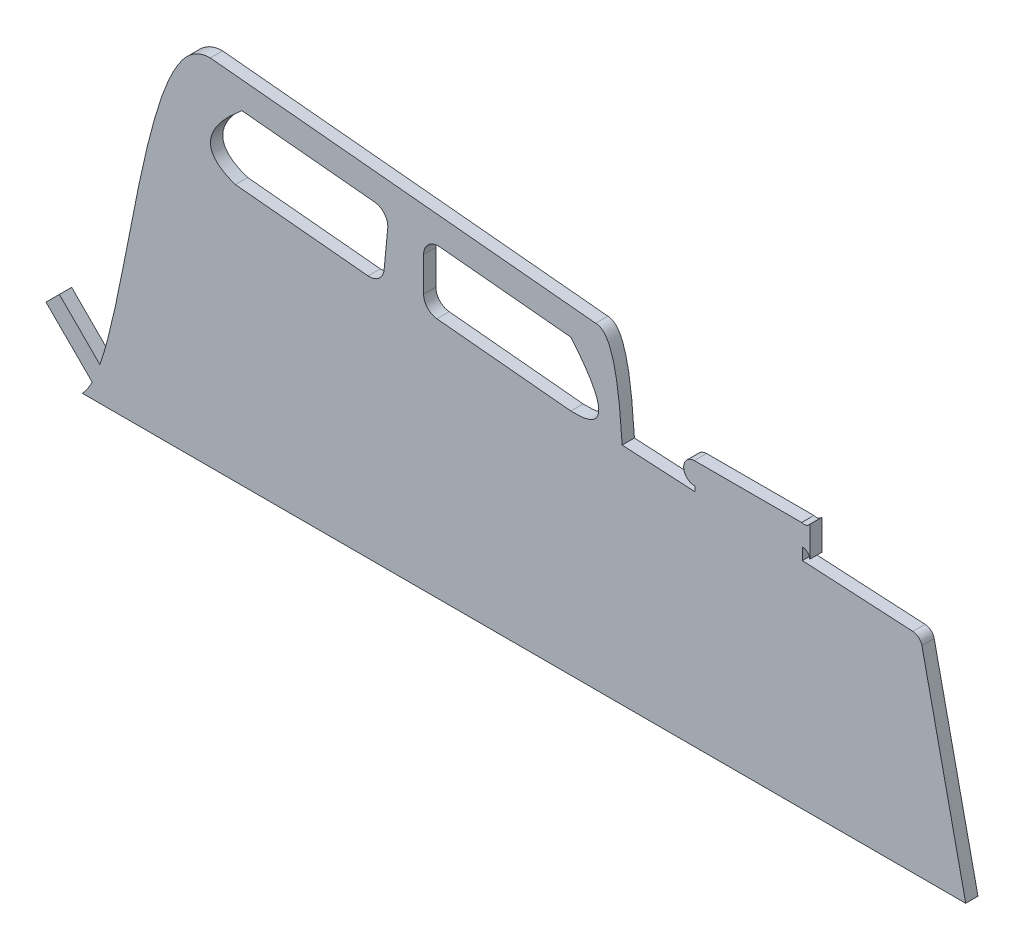
ISO-10303-21;
HEADER;
FILE_DESCRIPTION(('STEP AP214'),'2;1');
FILE_NAME('part.step','',(''),(''),'','','');
FILE_SCHEMA(('AUTOMOTIVE_DESIGN { 1 0 10303 214 1 1 1 1 }'));
ENDSEC;
DATA;
#1=APPLICATION_CONTEXT('core data for automotive mechanical design processes');
#2=APPLICATION_PROTOCOL_DEFINITION('international standard','automotive_design',2000,#1);
#3=PRODUCT_CONTEXT('',#1,'mechanical');
#4=PRODUCT('Part','Part','',(#3));
#5=PRODUCT_RELATED_PRODUCT_CATEGORY('part','',(#4));
#6=PRODUCT_DEFINITION_FORMATION('','',#4);
#7=PRODUCT_DEFINITION_CONTEXT('part definition',#1,'design');
#8=PRODUCT_DEFINITION('design','',#6,#7);
#9=PRODUCT_DEFINITION_SHAPE('','',#8);
#10=(LENGTH_UNIT() NAMED_UNIT(*) SI_UNIT(.MILLI.,.METRE.));
#11=(NAMED_UNIT(*) PLANE_ANGLE_UNIT() SI_UNIT($,.RADIAN.));
#12=(NAMED_UNIT(*) SI_UNIT($,.STERADIAN.) SOLID_ANGLE_UNIT());
#13=UNCERTAINTY_MEASURE_WITH_UNIT(LENGTH_MEASURE(1.E-05),#10,'distance_accuracy_value','');
#14=(GEOMETRIC_REPRESENTATION_CONTEXT(3) GLOBAL_UNCERTAINTY_ASSIGNED_CONTEXT((#13)) GLOBAL_UNIT_ASSIGNED_CONTEXT((#10,
#11,#12)) REPRESENTATION_CONTEXT('',''));
#15=CARTESIAN_POINT('',(0.,0.,0.));
#16=DIRECTION('',(0.,0.,1.));
#17=DIRECTION('',(1.,0.,0.));
#18=AXIS2_PLACEMENT_3D('',#15,#16,#17);
#19=CARTESIAN_POINT('',(3.17773604234742,3.17773604234742,3.175));
#20=DIRECTION('',(0.707106781186547,0.707106781186548,0.));
#21=DIRECTION('',(-0.707106781186548,0.707106781186547,0.));
#22=AXIS2_PLACEMENT_3D('',#19,#20,#21);
#23=PLANE('',#22);
#24=DIRECTION('',(0.707106781186548,-0.707106781186547,0.));
#25=VECTOR('',#24,1.);
#26=CARTESIAN_POINT('',(3.17773604234742,3.17773604234742,0.));
#27=LINE('',#26,#25);
#28=CARTESIAN_POINT('',(-9.36737866038823,15.7228507450831,0.));
#29=VERTEX_POINT('',#28);
#30=CARTESIAN_POINT('',(2.57905981794813,3.77641226674672,0.));
#31=VERTEX_POINT('',#30);
#32=EDGE_CURVE('E352',#29,#31,#27,.T.);
#33=ORIENTED_EDGE('',*,*,#32,.T.);
#34=DIRECTION('',(0.,0.,-1.));
#35=VECTOR('',#34,1.);
#36=CARTESIAN_POINT('',(2.57905981794813,3.77641226674672,3.175));
#37=LINE('',#36,#35);
#38=CARTESIAN_POINT('',(2.57905981794813,3.77641226674672,3.175));
#39=VERTEX_POINT('',#38);
#40=EDGE_CURVE('E11',#39,#31,#37,.T.);
#41=ORIENTED_EDGE('',*,*,#40,.F.);
#42=DIRECTION('',(0.707106781186548,-0.707106781186547,0.));
#43=VECTOR('',#42,1.);
#44=CARTESIAN_POINT('',(3.17773604234742,3.17773604234742,3.175));
#45=LINE('',#44,#43);
#46=CARTESIAN_POINT('',(-9.36737866038823,15.7228507450831,3.175));
#47=VERTEX_POINT('',#46);
#48=EDGE_CURVE('E363',#47,#39,#45,.T.);
#49=ORIENTED_EDGE('',*,*,#48,.F.);
#50=DIRECTION('',(0.,0.,-1.));
#51=VECTOR('',#50,1.);
#52=CARTESIAN_POINT('',(-9.36737866038823,15.7228507450831,3.175));
#53=LINE('',#52,#51);
#54=EDGE_CURVE('E485',#47,#29,#53,.T.);
#55=ORIENTED_EDGE('',*,*,#54,.T.);
#56=EDGE_LOOP('',(#33,#41,#49,#55));
#57=FACE_BOUND('',#56,.T.);
#58=ADVANCED_FACE('F35',(#57),#23,.F.);
#59=CARTESIAN_POINT('',(2.57905981794814,3.77641226674672,3.175));
#60=CARTESIAN_POINT('',(1.76772730176504,2.15682183703701,3.175));
#61=CARTESIAN_POINT('',(0.911850585689565,0.875503614465933,3.175));
#62=CARTESIAN_POINT('',(0.,0.,3.175));
#63=B_SPLINE_CURVE_WITH_KNOTS('',3,(#59,#60,#61,#62),.UNSPECIFIED.,.F.,.F.,(4,4),
(0.923802309139664,1.),.UNSPECIFIED.);
#64=DIRECTION('',(0.,0.,-1.));
#65=VECTOR('',#64,1.);
#66=SURFACE_OF_LINEAR_EXTRUSION('',#63,#65);
#67=CARTESIAN_POINT('',(2.57905981794814,3.77641226674672,0.));
#68=CARTESIAN_POINT('',(1.76772730176504,2.15682183703701,0.));
#69=CARTESIAN_POINT('',(0.911850585689565,0.875503614465933,0.));
#70=CARTESIAN_POINT('',(0.,0.,0.));
#71=B_SPLINE_CURVE_WITH_KNOTS('',3,(#67,#68,#69,#70),.UNSPECIFIED.,.F.,.F.,(4,4),
(0.923802309139664,1.),.UNSPECIFIED.);
#72=CARTESIAN_POINT('',(0.,0.,0.));
#73=VERTEX_POINT('',#72);
#74=EDGE_CURVE('E488',#31,#73,#71,.T.);
#75=ORIENTED_EDGE('',*,*,#74,.T.);
#76=DIRECTION('',(0.,0.,-1.));
#77=VECTOR('',#76,1.);
#78=CARTESIAN_POINT('',(0.,0.,3.175));
#79=LINE('',#78,#77);
#80=CARTESIAN_POINT('',(0.,0.,3.175));
#81=VERTEX_POINT('',#80);
#82=EDGE_CURVE('E42',#81,#73,#79,.T.);
#83=ORIENTED_EDGE('',*,*,#82,.F.);
#84=EDGE_CURVE('E366',#39,#81,#63,.T.);
#85=ORIENTED_EDGE('',*,*,#84,.F.);
#86=ORIENTED_EDGE('',*,*,#40,.T.);
#87=EDGE_LOOP('',(#75,#83,#85,#86));
#88=FACE_BOUND('',#87,.T.);
#89=ADVANCED_FACE('F377',(#88),#66,.F.);
#90=CARTESIAN_POINT('',(0.,0.,3.175));
#91=DIRECTION('',(0.,1.,0.));
#92=DIRECTION('',(0.,0.,1.));
#93=AXIS2_PLACEMENT_3D('',#90,#91,#92);
#94=PLANE('',#93);
#95=DIRECTION('',(1.,0.,0.));
#96=VECTOR('',#95,1.);
#97=CARTESIAN_POINT('',(0.,0.,0.));
#98=LINE('',#97,#96);
#99=CARTESIAN_POINT('',(228.6,0.,0.));
#100=VERTEX_POINT('',#99);
#101=EDGE_CURVE('E490',#73,#100,#98,.T.);
#102=ORIENTED_EDGE('',*,*,#101,.T.);
#103=DIRECTION('',(0.,0.,-1.));
#104=VECTOR('',#103,1.);
#105=CARTESIAN_POINT('',(228.6,0.,3.175));
#106=LINE('',#105,#104);
#107=CARTESIAN_POINT('',(228.6,0.,3.175));
#108=VERTEX_POINT('',#107);
#109=EDGE_CURVE('E587',#108,#100,#106,.T.);
#110=ORIENTED_EDGE('',*,*,#109,.F.);
#111=DIRECTION('',(1.,0.,0.));
#112=VECTOR('',#111,1.);
#113=CARTESIAN_POINT('',(0.,0.,3.175));
#114=LINE('',#113,#112);
#115=EDGE_CURVE('E372',#81,#108,#114,.T.);
#116=ORIENTED_EDGE('',*,*,#115,.F.);
#117=ORIENTED_EDGE('',*,*,#82,.T.);
#118=EDGE_LOOP('',(#102,#110,#116,#117));
#119=FACE_BOUND('',#118,.T.);
#120=ADVANCED_FACE('F380',(#119),#94,.F.);
#121=CARTESIAN_POINT('',(218.268204927033,47.4879180871345,3.175));
#122=DIRECTION('',(-0.977140750378376,-0.212593400532531,0.));
#123=DIRECTION('',(0.212593400532531,-0.977140750378376,0.));
#124=AXIS2_PLACEMENT_3D('',#121,#122,#123);
#125=PLANE('',#124);
#126=DIRECTION('',(-0.212593400532531,0.977140750378376,0.));
#127=VECTOR('',#126,1.);
#128=CARTESIAN_POINT('',(218.268204927033,47.4879180871345,0.));
#129=LINE('',#128,#127);
#130=CARTESIAN_POINT('',(217.266059517909,52.0940682056548,0.));
#131=VERTEX_POINT('',#130);
#132=EDGE_CURVE('E500',#100,#131,#129,.T.);
#133=ORIENTED_EDGE('',*,*,#132,.T.);
#134=DIRECTION('',(0.,0.,-1.));
#135=VECTOR('',#134,1.);
#136=CARTESIAN_POINT('',(217.266059517909,52.0940682056548,3.175));
#137=LINE('',#136,#135);
#138=CARTESIAN_POINT('',(217.266059517909,52.0940682056548,3.175));
#139=VERTEX_POINT('',#138);
#140=EDGE_CURVE('E584',#139,#131,#137,.T.);
#141=ORIENTED_EDGE('',*,*,#140,.F.);
#142=DIRECTION('',(-0.212593400532531,0.977140750378376,0.));
#143=VECTOR('',#142,1.);
#144=CARTESIAN_POINT('',(218.268204927033,47.4879180871345,3.175));
#145=LINE('',#144,#143);
#146=EDGE_CURVE('E605',#108,#139,#145,.T.);
#147=ORIENTED_EDGE('',*,*,#146,.F.);
#148=ORIENTED_EDGE('',*,*,#109,.T.);
#149=EDGE_LOOP('',(#133,#141,#147,#148));
#150=FACE_BOUND('',#149,.T.);
#151=ADVANCED_FACE('F384',(#150),#125,.F.);
#152=CARTESIAN_POINT('',(214.784122011948,51.5540809683022,3.175));
#153=DIRECTION('',(0.,0.,-1.));
#154=DIRECTION('',(-1.,0.,0.));
#155=AXIS2_PLACEMENT_3D('',#152,#153,#154);
#156=CYLINDRICAL_SURFACE('',#155,2.54000000000004);
#157=CARTESIAN_POINT('',(214.784122011948,51.5540809683022,0.));
#158=DIRECTION('',(0.,0.,1.));
#159=DIRECTION('',(1.,0.,0.));
#160=AXIS2_PLACEMENT_3D('',#157,#158,#159);
#161=CIRCLE('',#160,2.54000000000004);
#162=CARTESIAN_POINT('',(214.9236786523,54.0902442012455,0.));
#163=VERTEX_POINT('',#162);
#164=EDGE_CURVE('E502',#131,#163,#161,.T.);
#165=ORIENTED_EDGE('',*,*,#164,.T.);
#166=DIRECTION('',(0.,0.,-1.));
#167=VECTOR('',#166,1.);
#168=CARTESIAN_POINT('',(214.9236786523,54.0902442012455,3.175));
#169=LINE('',#168,#167);
#170=CARTESIAN_POINT('',(214.9236786523,54.0902442012455,3.175));
#171=VERTEX_POINT('',#170);
#172=EDGE_CURVE('E581',#171,#163,#169,.T.);
#173=ORIENTED_EDGE('',*,*,#172,.F.);
#174=CARTESIAN_POINT('',(214.784122011948,51.5540809683022,3.175));
#175=DIRECTION('',(0.,0.,1.));
#176=DIRECTION('',(1.,0.,0.));
#177=AXIS2_PLACEMENT_3D('',#174,#175,#176);
#178=CIRCLE('',#177,2.54000000000004);
#179=EDGE_CURVE('E601',#139,#171,#178,.T.);
#180=ORIENTED_EDGE('',*,*,#179,.F.);
#181=ORIENTED_EDGE('',*,*,#140,.T.);
#182=EDGE_LOOP('',(#165,#173,#180,#181));
#183=FACE_BOUND('',#182,.T.);
#184=ADVANCED_FACE('F388',(#183),#156,.T.);
#185=CARTESIAN_POINT('',(3.61623181099779,65.7177912689882,3.175));
#186=DIRECTION('',(-0.0549435591936934,-0.998489461788721,0.));
#187=DIRECTION('',(0.998489461788721,-0.0549435591936934,0.));
#188=AXIS2_PLACEMENT_3D('',#185,#186,#187);
#189=PLANE('',#188);
#190=DIRECTION('',(-0.998489461788721,0.0549435591936934,0.));
#191=VECTOR('',#190,1.);
#192=CARTESIAN_POINT('',(3.61623181099779,65.7177912689882,0.));
#193=LINE('',#192,#191);
#194=CARTESIAN_POINT('',(186.335881613567,55.6633357349319,0.));
#195=VERTEX_POINT('',#194);
#196=EDGE_CURVE('E504',#163,#195,#193,.T.);
#197=ORIENTED_EDGE('',*,*,#196,.T.);
#198=DIRECTION('',(0.,0.,-1.));
#199=VECTOR('',#198,1.);
#200=CARTESIAN_POINT('',(186.335881613567,55.6633357349319,3.175));
#201=LINE('',#200,#199);
#202=CARTESIAN_POINT('',(186.335881613567,55.6633357349319,3.175));
#203=VERTEX_POINT('',#202);
#204=EDGE_CURVE('E579',#203,#195,#201,.T.);
#205=ORIENTED_EDGE('',*,*,#204,.F.);
#206=DIRECTION('',(-0.998489461788721,0.0549435591936934,0.));
#207=VECTOR('',#206,1.);
#208=CARTESIAN_POINT('',(3.61623181099779,65.7177912689882,3.175));
#209=LINE('',#208,#207);
#210=EDGE_CURVE('E604',#171,#203,#209,.T.);
#211=ORIENTED_EDGE('',*,*,#210,.F.);
#212=ORIENTED_EDGE('',*,*,#172,.T.);
#213=EDGE_LOOP('',(#197,#205,#211,#212));
#214=FACE_BOUND('',#213,.T.);
#215=ADVANCED_FACE('F392',(#214),#189,.F.);
#216=CARTESIAN_POINT('',(186.335881613569,5.09041304333689E-12,3.175));
#217=DIRECTION('',(1.,0.,0.));
#218=DIRECTION('',(0.,1.,0.));
#219=AXIS2_PLACEMENT_3D('',#216,#217,#218);
#220=PLANE('',#219);
#221=DIRECTION('',(0.,-1.,0.));
#222=VECTOR('',#221,1.);
#223=CARTESIAN_POINT('',(186.335881613569,5.09041304333689E-12,0.));
#224=LINE('',#223,#222);
#225=CARTESIAN_POINT('',(186.335881613567,58.7113357349319,0.));
#226=VERTEX_POINT('',#225);
#227=EDGE_CURVE('E507',#226,#195,#224,.T.);
#228=ORIENTED_EDGE('',*,*,#227,.F.);
#229=DIRECTION('',(0.,0.,-1.));
#230=VECTOR('',#229,1.);
#231=CARTESIAN_POINT('',(186.335881613567,58.7113357349319,3.175));
#232=LINE('',#231,#230);
#233=CARTESIAN_POINT('',(186.335881613567,58.7113357349319,3.175));
#234=VERTEX_POINT('',#233);
#235=EDGE_CURVE('E577',#234,#226,#232,.T.);
#236=ORIENTED_EDGE('',*,*,#235,.F.);
#237=DIRECTION('',(0.,-1.,0.));
#238=VECTOR('',#237,1.);
#239=CARTESIAN_POINT('',(186.335881613569,5.09041304333689E-12,3.175));
#240=LINE('',#239,#238);
#241=EDGE_CURVE('E607',#234,#203,#240,.T.);
#242=ORIENTED_EDGE('',*,*,#241,.T.);
#243=ORIENTED_EDGE('',*,*,#204,.T.);
#244=EDGE_LOOP('',(#228,#236,#242,#243));
#245=FACE_BOUND('',#244,.T.);
#246=ADVANCED_FACE('F396',(#245),#220,.T.);
#247=CARTESIAN_POINT('',(186.392581362174,56.8531491120236,3.175));
#248=DIRECTION('',(0.,0.,-1.));
#249=DIRECTION('',(-1.,0.,0.));
#250=AXIS2_PLACEMENT_3D('',#247,#248,#249);
#251=CYLINDRICAL_SURFACE('',#250,1.85905147509361);
#252=CARTESIAN_POINT('',(186.392581362174,56.8531491120236,0.));
#253=DIRECTION('',(0.,0.,1.));
#254=DIRECTION('',(1.,0.,0.));
#255=AXIS2_PLACEMENT_3D('',#252,#253,#254);
#256=CIRCLE('',#255,1.85905147509361);
#257=CARTESIAN_POINT('',(188.250106948473,56.9284557072932,0.));
#258=VERTEX_POINT('',#257);
#259=EDGE_CURVE('E510',#226,#258,#256,.F.);
#260=ORIENTED_EDGE('',*,*,#259,.T.);
#261=DIRECTION('',(0.,0.,-1.));
#262=VECTOR('',#261,1.);
#263=CARTESIAN_POINT('',(188.250106948473,56.9284557072932,3.175));
#264=LINE('',#263,#262);
#265=CARTESIAN_POINT('',(188.250106948473,56.9284557072932,3.175));
#266=VERTEX_POINT('',#265);
#267=EDGE_CURVE('E575',#266,#258,#264,.T.);
#268=ORIENTED_EDGE('',*,*,#267,.F.);
#269=CARTESIAN_POINT('',(186.392581362174,56.8531491120236,3.175));
#270=DIRECTION('',(0.,0.,1.));
#271=DIRECTION('',(1.,0.,0.));
#272=AXIS2_PLACEMENT_3D('',#269,#270,#271);
#273=CIRCLE('',#272,1.85905147509361);
#274=EDGE_CURVE('E612',#234,#266,#273,.F.);
#275=ORIENTED_EDGE('',*,*,#274,.F.);
#276=ORIENTED_EDGE('',*,*,#235,.T.);
#277=EDGE_LOOP('',(#260,#268,#275,#276));
#278=FACE_BOUND('',#277,.T.);
#279=ADVANCED_FACE('F400',(#278),#251,.F.);
#280=CARTESIAN_POINT('',(188.250106948473,0.,3.175));
#281=DIRECTION('',(1.,0.,0.));
#282=DIRECTION('',(0.,0.,-1.));
#283=AXIS2_PLACEMENT_3D('',#280,#281,#282);
#284=PLANE('',#283);
#285=DIRECTION('',(0.,-1.,0.));
#286=VECTOR('',#285,1.);
#287=CARTESIAN_POINT('',(188.250106948473,0.,0.));
#288=LINE('',#287,#286);
#289=CARTESIAN_POINT('',(188.250106948473,64.7514185913259,0.));
#290=VERTEX_POINT('',#289);
#291=EDGE_CURVE('E513',#290,#258,#288,.T.);
#292=ORIENTED_EDGE('',*,*,#291,.F.);
#293=DIRECTION('',(0.,0.,-1.));
#294=VECTOR('',#293,1.);
#295=CARTESIAN_POINT('',(188.250106948473,64.7514185913259,3.175));
#296=LINE('',#295,#294);
#297=CARTESIAN_POINT('',(188.250106948473,64.7514185913259,3.175));
#298=VERTEX_POINT('',#297);
#299=EDGE_CURVE('E573',#298,#290,#296,.T.);
#300=ORIENTED_EDGE('',*,*,#299,.F.);
#301=DIRECTION('',(0.,-1.,0.));
#302=VECTOR('',#301,1.);
#303=CARTESIAN_POINT('',(188.250106948473,0.,3.175));
#304=LINE('',#303,#302);
#305=EDGE_CURVE('E614',#298,#266,#304,.T.);
#306=ORIENTED_EDGE('',*,*,#305,.T.);
#307=ORIENTED_EDGE('',*,*,#267,.T.);
#308=EDGE_LOOP('',(#292,#300,#306,#307));
#309=FACE_BOUND('',#308,.T.);
#310=ADVANCED_FACE('F404',(#309),#284,.T.);
#311=CARTESIAN_POINT('',(186.750930549627,65.8507558972469,3.175));
#312=DIRECTION('',(0.,0.,-1.));
#313=DIRECTION('',(-1.,0.,0.));
#314=AXIS2_PLACEMENT_3D('',#311,#312,#313);
#315=CYLINDRICAL_SURFACE('',#314,1.85905147509361);
#316=CARTESIAN_POINT('',(186.750930549627,65.8507558972469,0.));
#317=DIRECTION('',(0.,0.,1.));
#318=DIRECTION('',(1.,0.,0.));
#319=AXIS2_PLACEMENT_3D('',#316,#317,#318);
#320=CIRCLE('',#319,1.85905147509361);
#321=CARTESIAN_POINT('',(186.139401366503,64.095163562667,0.));
#322=VERTEX_POINT('',#321);
#323=EDGE_CURVE('E516',#322,#290,#320,.T.);
#324=ORIENTED_EDGE('',*,*,#323,.F.);
#325=DIRECTION('',(0.,0.,-1.));
#326=VECTOR('',#325,1.);
#327=CARTESIAN_POINT('',(186.139401366503,64.095163562667,3.175));
#328=LINE('',#327,#326);
#329=CARTESIAN_POINT('',(186.139401366503,64.095163562667,3.175));
#330=VERTEX_POINT('',#329);
#331=EDGE_CURVE('E571',#330,#322,#328,.T.);
#332=ORIENTED_EDGE('',*,*,#331,.F.);
#333=CARTESIAN_POINT('',(186.750930549627,65.8507558972469,3.175));
#334=DIRECTION('',(0.,0.,1.));
#335=DIRECTION('',(1.,0.,0.));
#336=AXIS2_PLACEMENT_3D('',#333,#334,#335);
#337=CIRCLE('',#336,1.85905147509361);
#338=EDGE_CURVE('E617',#330,#298,#337,.T.);
#339=ORIENTED_EDGE('',*,*,#338,.T.);
#340=ORIENTED_EDGE('',*,*,#299,.T.);
#341=EDGE_LOOP('',(#324,#332,#339,#340));
#342=FACE_BOUND('',#341,.T.);
#343=ADVANCED_FACE('F408',(#342),#315,.F.);
#344=CARTESIAN_POINT('',(0.,64.095163562667,3.175));
#345=DIRECTION('',(0.,-1.,0.));
#346=DIRECTION('',(0.,0.,-1.));
#347=AXIS2_PLACEMENT_3D('',#344,#345,#346);
#348=PLANE('',#347);
#349=DIRECTION('',(-1.,0.,0.));
#350=VECTOR('',#349,1.);
#351=CARTESIAN_POINT('',(0.,64.095163562667,0.));
#352=LINE('',#351,#350);
#353=CARTESIAN_POINT('',(158.379745693979,64.095163562667,0.));
#354=VERTEX_POINT('',#353);
#355=EDGE_CURVE('E519',#322,#354,#352,.T.);
#356=ORIENTED_EDGE('',*,*,#355,.T.);
#357=DIRECTION('',(0.,0.,-1.));
#358=VECTOR('',#357,1.);
#359=CARTESIAN_POINT('',(158.379745693979,64.095163562667,3.175));
#360=LINE('',#359,#358);
#361=CARTESIAN_POINT('',(158.379745693979,64.095163562667,3.175));
#362=VERTEX_POINT('',#361);
#363=EDGE_CURVE('E569',#362,#354,#360,.T.);
#364=ORIENTED_EDGE('',*,*,#363,.F.);
#365=DIRECTION('',(-1.,0.,0.));
#366=VECTOR('',#365,1.);
#367=CARTESIAN_POINT('',(0.,64.095163562667,3.175));
#368=LINE('',#367,#366);
#369=EDGE_CURVE('E620',#330,#362,#368,.T.);
#370=ORIENTED_EDGE('',*,*,#369,.F.);
#371=ORIENTED_EDGE('',*,*,#331,.T.);
#372=EDGE_LOOP('',(#356,#364,#370,#371));
#373=FACE_BOUND('',#372,.T.);
#374=ADVANCED_FACE('F412',(#373),#348,.F.);
#375=CARTESIAN_POINT('',(158.436135479708,61.2803133661491,3.175));
#376=DIRECTION('',(0.,0.,-1.));
#377=DIRECTION('',(-1.,0.,0.));
#378=AXIS2_PLACEMENT_3D('',#375,#376,#377);
#379=CYLINDRICAL_SURFACE('',#378,2.81541496706464);
#380=CARTESIAN_POINT('',(158.436135479708,61.2803133661491,0.));
#381=DIRECTION('',(0.,0.,1.));
#382=DIRECTION('',(1.,0.,0.));
#383=AXIS2_PLACEMENT_3D('',#380,#381,#382);
#384=CIRCLE('',#383,2.81541496706464);
#385=CARTESIAN_POINT('',(158.492525265438,58.4654631696312,0.));
#386=VERTEX_POINT('',#385);
#387=EDGE_CURVE('E522',#386,#354,#384,.F.);
#388=ORIENTED_EDGE('',*,*,#387,.F.);
#389=DIRECTION('',(0.,0.,-1.));
#390=VECTOR('',#389,1.);
#391=CARTESIAN_POINT('',(158.492525265438,58.4654631696312,3.175));
#392=LINE('',#391,#390);
#393=CARTESIAN_POINT('',(158.492525265438,58.4654631696312,3.175));
#394=VERTEX_POINT('',#393);
#395=EDGE_CURVE('E567',#394,#386,#392,.T.);
#396=ORIENTED_EDGE('',*,*,#395,.F.);
#397=CARTESIAN_POINT('',(158.436135479708,61.2803133661491,3.175));
#398=DIRECTION('',(0.,0.,1.));
#399=DIRECTION('',(1.,0.,0.));
#400=AXIS2_PLACEMENT_3D('',#397,#398,#399);
#401=CIRCLE('',#400,2.81541496706464);
#402=EDGE_CURVE('E622',#394,#362,#401,.F.);
#403=ORIENTED_EDGE('',*,*,#402,.T.);
#404=ORIENTED_EDGE('',*,*,#363,.T.);
#405=EDGE_LOOP('',(#388,#396,#403,#404));
#406=FACE_BOUND('',#405,.T.);
#407=ADVANCED_FACE('F416',(#406),#379,.T.);
#408=CARTESIAN_POINT('',(158.492525265439,3.46381989725738E-12,3.175));
#409=DIRECTION('',(-1.,0.,0.));
#410=DIRECTION('',(0.,-1.,0.));
#411=AXIS2_PLACEMENT_3D('',#408,#409,#410);
#412=PLANE('',#411);
#413=DIRECTION('',(0.,1.,0.));
#414=VECTOR('',#413,1.);
#415=CARTESIAN_POINT('',(158.492525265439,3.46381989725738E-12,0.));
#416=LINE('',#415,#414);
#417=CARTESIAN_POINT('',(158.492525265438,57.1954631696312,0.));
#418=VERTEX_POINT('',#417);
#419=EDGE_CURVE('E525',#418,#386,#416,.T.);
#420=ORIENTED_EDGE('',*,*,#419,.F.);
#421=DIRECTION('',(0.,0.,-1.));
#422=VECTOR('',#421,1.);
#423=CARTESIAN_POINT('',(158.492525265438,57.1954631696312,3.175));
#424=LINE('',#423,#422);
#425=CARTESIAN_POINT('',(158.492525265438,57.1954631696312,3.175));
#426=VERTEX_POINT('',#425);
#427=EDGE_CURVE('E565',#426,#418,#424,.T.);
#428=ORIENTED_EDGE('',*,*,#427,.F.);
#429=DIRECTION('',(0.,1.,0.));
#430=VECTOR('',#429,1.);
#431=CARTESIAN_POINT('',(158.492525265439,3.46381989725738E-12,3.175));
#432=LINE('',#431,#430);
#433=EDGE_CURVE('E624',#426,#394,#432,.T.);
#434=ORIENTED_EDGE('',*,*,#433,.T.);
#435=ORIENTED_EDGE('',*,*,#395,.T.);
#436=EDGE_LOOP('',(#420,#428,#434,#435));
#437=FACE_BOUND('',#436,.T.);
#438=ADVANCED_FACE('F420',(#437),#412,.T.);
#439=CARTESIAN_POINT('',(3.6162318109978,65.7177912689882,3.175));
#440=DIRECTION('',(-0.0549435591936935,-0.998489461788721,0.));
#441=DIRECTION('',(0.998489461788721,-0.0549435591936935,0.));
#442=AXIS2_PLACEMENT_3D('',#439,#440,#441);
#443=PLANE('',#442);
#444=DIRECTION('',(-0.998489461788721,0.0549435591936935,0.));
#445=VECTOR('',#444,1.);
#446=CARTESIAN_POINT('',(3.6162318109978,65.7177912689882,0.));
#447=LINE('',#446,#445);
#448=CARTESIAN_POINT('',(139.704230031469,58.2293206622149,0.));
#449=VERTEX_POINT('',#448);
#450=EDGE_CURVE('E528',#418,#449,#447,.T.);
#451=ORIENTED_EDGE('',*,*,#450,.T.);
#452=DIRECTION('',(0.,0.,-1.));
#453=VECTOR('',#452,1.);
#454=CARTESIAN_POINT('',(139.704230031469,58.2293206622149,3.175));
#455=LINE('',#454,#453);
#456=CARTESIAN_POINT('',(139.704230031469,58.2293206622149,3.175));
#457=VERTEX_POINT('',#456);
#458=EDGE_CURVE('E562',#457,#449,#455,.T.);
#459=ORIENTED_EDGE('',*,*,#458,.F.);
#460=DIRECTION('',(-0.998489461788721,0.0549435591936935,0.));
#461=VECTOR('',#460,1.);
#462=CARTESIAN_POINT('',(3.6162318109978,65.7177912689882,3.175));
#463=LINE('',#462,#461);
#464=EDGE_CURVE('E443',#426,#457,#463,.T.);
#465=ORIENTED_EDGE('',*,*,#464,.F.);
#466=ORIENTED_EDGE('',*,*,#427,.T.);
#467=EDGE_LOOP('',(#451,#459,#465,#466));
#468=FACE_BOUND('',#467,.T.);
#469=ADVANCED_FACE('F424',(#468),#443,.F.);
#470=CARTESIAN_POINT('',(139.704230031469,58.2293206622149,3.175));
#471=CARTESIAN_POINT('',(139.045260228029,67.7754216270836,3.175));
#472=CARTESIAN_POINT('',(137.977027939534,82.0991427712091,3.175));
#473=CARTESIAN_POINT('',(132.841802065302,82.0991427712091,3.175));
#474=B_SPLINE_CURVE_WITH_KNOTS('',3,(#470,#471,#472,#473),.UNSPECIFIED.,.F.,.F.,(4,4),(0.,1.),.UNSPECIFIED.);
#475=DIRECTION('',(0.,0.,-1.));
#476=VECTOR('',#475,1.);
#477=SURFACE_OF_LINEAR_EXTRUSION('',#474,#476);
#478=CARTESIAN_POINT('',(139.704230031469,58.2293206622149,0.));
#479=CARTESIAN_POINT('',(139.045260228029,67.7754216270836,0.));
#480=CARTESIAN_POINT('',(137.977027939534,82.0991427712091,0.));
#481=CARTESIAN_POINT('',(132.841802065302,82.0991427712091,0.));
#482=B_SPLINE_CURVE_WITH_KNOTS('',3,(#478,#479,#480,#481),.UNSPECIFIED.,.F.,.F.,(4,4),(0.,1.),.UNSPECIFIED.);
#483=CARTESIAN_POINT('',(132.841802065302,82.0991427712091,0.));
#484=VERTEX_POINT('',#483);
#485=EDGE_CURVE('E530',#449,#484,#482,.T.);
#486=ORIENTED_EDGE('',*,*,#485,.T.);
#487=DIRECTION('',(0.,0.,-1.));
#488=VECTOR('',#487,1.);
#489=CARTESIAN_POINT('',(132.841802065302,82.0991427712091,3.175));
#490=LINE('',#489,#488);
#491=CARTESIAN_POINT('',(132.841802065302,82.0991427712091,3.175));
#492=VERTEX_POINT('',#491);
#493=EDGE_CURVE('E559',#492,#484,#490,.T.);
#494=ORIENTED_EDGE('',*,*,#493,.F.);
#495=EDGE_CURVE('E436',#457,#492,#474,.T.);
#496=ORIENTED_EDGE('',*,*,#495,.F.);
#497=ORIENTED_EDGE('',*,*,#458,.T.);
#498=EDGE_LOOP('',(#486,#494,#496,#497));
#499=FACE_BOUND('',#498,.T.);
#500=ADVANCED_FACE('F428',(#499),#477,.F.);
#501=CARTESIAN_POINT('',(9.04939059623252,94.0147787879643,3.175));
#502=DIRECTION('',(-0.0958121519412626,-0.995399433162579,0.));
#503=DIRECTION('',(0.99539943316258,-0.0958121519412626,0.));
#504=AXIS2_PLACEMENT_3D('',#501,#502,#503);
#505=PLANE('',#504);
#506=DIRECTION('',(-0.99539943316258,0.0958121519412626,0.));
#507=VECTOR('',#506,1.);
#508=CARTESIAN_POINT('',(9.04939059623252,94.0147787879643,0.));
#509=LINE('',#508,#507);
#510=CARTESIAN_POINT('',(33.1359272454291,91.6963296987989,0.));
#511=VERTEX_POINT('',#510);
#512=EDGE_CURVE('E534',#484,#511,#509,.T.);
#513=ORIENTED_EDGE('',*,*,#512,.T.);
#514=DIRECTION('',(0.,0.,-1.));
#515=VECTOR('',#514,1.);
#516=CARTESIAN_POINT('',(33.1359272454291,91.6963296987989,3.175));
#517=LINE('',#516,#515);
#518=CARTESIAN_POINT('',(33.1359272454291,91.6963296987989,3.175));
#519=VERTEX_POINT('',#518);
#520=EDGE_CURVE('E556',#519,#511,#517,.T.);
#521=ORIENTED_EDGE('',*,*,#520,.F.);
#522=DIRECTION('',(-0.99539943316258,0.0958121519412626,0.));
#523=VECTOR('',#522,1.);
#524=CARTESIAN_POINT('',(9.04939059623252,94.0147787879643,3.175));
#525=LINE('',#524,#523);
#526=EDGE_CURVE('E442',#492,#519,#525,.T.);
#527=ORIENTED_EDGE('',*,*,#526,.F.);
#528=ORIENTED_EDGE('',*,*,#493,.T.);
#529=EDGE_LOOP('',(#513,#521,#527,#528));
#530=FACE_BOUND('',#529,.T.);
#531=ADVANCED_FACE('F433',(#530),#505,.F.);
#532=CARTESIAN_POINT('',(33.1359272454291,91.6963296987989,3.175));
#533=CARTESIAN_POINT('',(29.9929467551193,91.6963296987989,3.175));
#534=CARTESIAN_POINT('',(16.2189014675502,82.0710965598908,3.175));
#535=CARTESIAN_POINT('',(11.469233025731,28.631681198395,3.175));
#536=CARTESIAN_POINT('',(4.58927934047994,8.68731164047935,3.175));
#537=B_SPLINE_CURVE_WITH_KNOTS('',3,(#532,#533,#534,#535,#536),.UNSPECIFIED.,.F.,.F.,(4,1,4),
(0.,0.152321430407235,0.857980153674609),.UNSPECIFIED.);
#538=DIRECTION('',(0.,0.,-1.));
#539=VECTOR('',#538,1.);
#540=SURFACE_OF_LINEAR_EXTRUSION('',#537,#539);
#541=CARTESIAN_POINT('',(33.1359272454291,91.6963296987989,0.));
#542=CARTESIAN_POINT('',(29.9929467551193,91.6963296987989,0.));
#543=CARTESIAN_POINT('',(16.2189014675502,82.0710965598908,0.));
#544=CARTESIAN_POINT('',(11.469233025731,28.631681198395,0.));
#545=CARTESIAN_POINT('',(4.58927934047994,8.68731164047935,0.));
#546=B_SPLINE_CURVE_WITH_KNOTS('',3,(#541,#542,#543,#544,#545),.UNSPECIFIED.,.F.,.F.,(4,1,4),
(0.,0.152321430407235,0.857980153674609),.UNSPECIFIED.);
#547=CARTESIAN_POINT('',(4.58927934047994,8.68731164047935,0.));
#548=VERTEX_POINT('',#547);
#549=EDGE_CURVE('E539',#511,#548,#546,.T.);
#550=ORIENTED_EDGE('',*,*,#549,.T.);
#551=DIRECTION('',(0.,0.,-1.));
#552=VECTOR('',#551,1.);
#553=CARTESIAN_POINT('',(4.58927934047994,8.68731164047935,3.175));
#554=LINE('',#553,#552);
#555=CARTESIAN_POINT('',(4.58927934047994,8.68731164047935,3.175));
#556=VERTEX_POINT('',#555);
#557=EDGE_CURVE('E553',#556,#548,#554,.T.);
#558=ORIENTED_EDGE('',*,*,#557,.F.);
#559=EDGE_CURVE('E449',#519,#556,#537,.T.);
#560=ORIENTED_EDGE('',*,*,#559,.F.);
#561=ORIENTED_EDGE('',*,*,#520,.T.);
#562=EDGE_LOOP('',(#550,#558,#560,#561));
#563=FACE_BOUND('',#562,.T.);
#564=ADVANCED_FACE('F459',(#563),#540,.F.);
#565=CARTESIAN_POINT('',(6.63829549047965,6.63829549047965,3.175));
#566=DIRECTION('',(-0.707106781186548,-0.707106781186548,0.));
#567=DIRECTION('',(0.707106781186548,-0.707106781186548,0.));
#568=AXIS2_PLACEMENT_3D('',#565,#566,#567);
#569=PLANE('',#568);
#570=DIRECTION('',(-0.707106781186548,0.707106781186548,0.));
#571=VECTOR('',#570,1.);
#572=CARTESIAN_POINT('',(6.63829549047965,6.63829549047965,0.));
#573=LINE('',#572,#571);
#574=CARTESIAN_POINT('',(-5.906819212256,19.1834101932153,0.));
#575=VERTEX_POINT('',#574);
#576=EDGE_CURVE('E543',#548,#575,#573,.T.);
#577=ORIENTED_EDGE('',*,*,#576,.T.);
#578=DIRECTION('',(0.,0.,-1.));
#579=VECTOR('',#578,1.);
#580=CARTESIAN_POINT('',(-5.906819212256,19.1834101932153,3.175));
#581=LINE('',#580,#579);
#582=CARTESIAN_POINT('',(-5.906819212256,19.1834101932153,3.175));
#583=VERTEX_POINT('',#582);
#584=EDGE_CURVE('E550',#583,#575,#581,.T.);
#585=ORIENTED_EDGE('',*,*,#584,.F.);
#586=DIRECTION('',(-0.707106781186548,0.707106781186548,0.));
#587=VECTOR('',#586,1.);
#588=CARTESIAN_POINT('',(6.63829549047965,6.63829549047965,3.175));
#589=LINE('',#588,#587);
#590=EDGE_CURVE('E454',#556,#583,#589,.T.);
#591=ORIENTED_EDGE('',*,*,#590,.F.);
#592=ORIENTED_EDGE('',*,*,#557,.T.);
#593=EDGE_LOOP('',(#577,#585,#591,#592));
#594=FACE_BOUND('',#593,.T.);
#595=ADVANCED_FACE('F462',(#594),#569,.F.);
#596=CARTESIAN_POINT('',(-12.5451147027356,12.5451147027356,3.175));
#597=DIRECTION('',(0.707106781186548,-0.707106781186547,0.));
#598=DIRECTION('',(0.707106781186547,0.707106781186548,0.));
#599=AXIS2_PLACEMENT_3D('',#596,#597,#598);
#600=PLANE('',#599);
#601=DIRECTION('',(-0.707106781186547,-0.707106781186548,0.));
#602=VECTOR('',#601,1.);
#603=CARTESIAN_POINT('',(-12.5451147027356,12.5451147027356,0.));
#604=LINE('',#603,#602);
#605=EDGE_CURVE('E367',#575,#29,#604,.T.);
#606=ORIENTED_EDGE('',*,*,#605,.T.);
#607=ORIENTED_EDGE('',*,*,#54,.F.);
#608=DIRECTION('',(-0.707106781186547,-0.707106781186548,0.));
#609=VECTOR('',#608,1.);
#610=CARTESIAN_POINT('',(-12.5451147027356,12.5451147027356,3.175));
#611=LINE('',#610,#609);
#612=EDGE_CURVE('E492',#583,#47,#611,.T.);
#613=ORIENTED_EDGE('',*,*,#612,.F.);
#614=ORIENTED_EDGE('',*,*,#584,.T.);
#615=EDGE_LOOP('',(#606,#607,#613,#614));
#616=FACE_BOUND('',#615,.T.);
#617=ADVANCED_FACE('F466',(#616),#600,.F.);
#618=CARTESIAN_POINT('',(0.,0.,3.175));
#619=DIRECTION('',(0.,0.,1.));
#620=DIRECTION('',(1.,0.,0.));
#621=AXIS2_PLACEMENT_3D('',#618,#619,#620);
#622=PLANE('',#621);
#623=CARTESIAN_POINT('',(126.433071174675,59.2334337782453,3.175));
#624=CARTESIAN_POINT('',(140.857755691918,58.5967388552196,3.175));
#625=CARTESIAN_POINT('',(126.433071174675,75.7744189989911,3.175));
#626=B_SPLINE_CURVE_WITH_KNOTS('',2,(#623,#624,#625),.UNSPECIFIED.,.F.,.F.,(3,3),(0.,1.),.UNSPECIFIED.);
#627=CARTESIAN_POINT('',(126.433071174675,59.2334337782453,3.175));
#628=VERTEX_POINT('',#627);
#629=CARTESIAN_POINT('',(126.433071174675,75.7744189989911,3.175));
#630=VERTEX_POINT('',#629);
#631=EDGE_CURVE('E49',#628,#630,#626,.T.);
#632=ORIENTED_EDGE('',*,*,#631,.F.);
#633=DIRECTION('',(0.99539943316258,-0.0958121519412623,0.));
#634=VECTOR('',#633,1.);
#635=CARTESIAN_POINT('',(91.7780268757784,62.5691543536002,3.175));
#636=LINE('',#635,#634);
#637=CARTESIAN_POINT('',(91.7780268757784,62.5691543536002,3.175));
#638=VERTEX_POINT('',#637);
#639=EDGE_CURVE('E256',#638,#628,#636,.T.);
#640=ORIENTED_EDGE('',*,*,#639,.F.);
#641=CARTESIAN_POINT('',(92.1430711746746,66.3616261939497,3.175));
#642=DIRECTION('',(0.,0.,1.));
#643=DIRECTION('',(1.,0.,0.));
#644=AXIS2_PLACEMENT_3D('',#641,#642,#643);
#645=CIRCLE('',#644,3.81);
#646=CARTESIAN_POINT('',(88.3330711746746,66.3616261939497,3.175));
#647=VERTEX_POINT('',#646);
#648=EDGE_CURVE('E259',#647,#638,#645,.T.);
#649=ORIENTED_EDGE('',*,*,#648,.F.);
#650=DIRECTION('',(0.,-1.,0.));
#651=VECTOR('',#650,1.);
#652=CARTESIAN_POINT('',(88.3330711746746,75.2473930710504,3.175));
#653=LINE('',#652,#651);
#654=CARTESIAN_POINT('',(88.3330711746746,75.2473930710504,3.175));
#655=VERTEX_POINT('',#654);
#656=EDGE_CURVE('E781',#655,#647,#653,.T.);
#657=ORIENTED_EDGE('',*,*,#656,.F.);
#658=CARTESIAN_POINT('',(92.1430711746746,75.2473930710505,3.175));
#659=DIRECTION('',(0.,0.,1.));
#660=DIRECTION('',(1.,0.,0.));
#661=AXIS2_PLACEMENT_3D('',#658,#659,#660);
#662=CIRCLE('',#661,3.81);
#663=CARTESIAN_POINT('',(92.5081154735708,79.0398649113999,3.175));
#664=VERTEX_POINT('',#663);
#665=EDGE_CURVE('E777',#664,#655,#662,.T.);
#666=ORIENTED_EDGE('',*,*,#665,.F.);
#667=DIRECTION('',(-0.99539943316258,0.0958121519412624,0.));
#668=VECTOR('',#667,1.);
#669=CARTESIAN_POINT('',(92.5081154735708,79.0398649113999,3.175));
#670=LINE('',#669,#668);
#671=EDGE_CURVE('E782',#630,#664,#670,.T.);
#672=ORIENTED_EDGE('',*,*,#671,.F.);
#673=EDGE_LOOP('',(#632,#640,#649,#657,#666,#672));
#674=FACE_BOUND('',#673,.T.);
#675=CARTESIAN_POINT('',(41.3176551720355,83.9672016135826,3.175));
#676=CARTESIAN_POINT('',(25.9479651058857,71.2641342917531,3.175));
#677=CARTESIAN_POINT('',(39.6429014632038,66.5680632090938,3.175));
#678=B_SPLINE_CURVE_WITH_KNOTS('',2,(#675,#676,#677),.UNSPECIFIED.,.F.,.F.,(3,3),(0.,1.),.UNSPECIFIED.);
#679=CARTESIAN_POINT('',(41.3176551720355,83.9672016135826,3.175));
#680=VERTEX_POINT('',#679);
#681=CARTESIAN_POINT('',(39.6429014632038,66.5680632090938,3.175));
#682=VERTEX_POINT('',#681);
#683=EDGE_CURVE('E328',#680,#682,#678,.T.);
#684=ORIENTED_EDGE('',*,*,#683,.F.);
#685=DIRECTION('',(-0.995399433162579,0.0958121519412626,0.));
#686=VECTOR('',#685,1.);
#687=CARTESIAN_POINT('',(41.3176551720355,83.9672016135826,3.175));
#688=LINE('',#687,#686);
#689=CARTESIAN_POINT('',(75.625183331686,80.6649311970546,3.175));
#690=VERTEX_POINT('',#689);
#691=EDGE_CURVE('E308',#690,#680,#688,.T.);
#692=ORIENTED_EDGE('',*,*,#691,.F.);
#693=CARTESIAN_POINT('',(75.2601390327898,76.8724593567051,3.175));
#694=DIRECTION('',(0.,0.,1.));
#695=DIRECTION('',(1.,0.,0.));
#696=AXIS2_PLACEMENT_3D('',#693,#694,#695);
#697=CIRCLE('',#696,3.81);
#698=CARTESIAN_POINT('',(79.0526108731392,76.5074150578089,3.175));
#699=VERTEX_POINT('',#698);
#700=EDGE_CURVE('E345',#699,#690,#697,.T.);
#701=ORIENTED_EDGE('',*,*,#700,.F.);
#702=DIRECTION('',(0.0958121519412633,0.99539943316258,0.));
#703=VECTOR('',#702,1.);
#704=CARTESIAN_POINT('',(79.0526108731392,76.5074150578089,3.175));
#705=LINE('',#704,#703);
#706=CARTESIAN_POINT('',(78.1079457621,66.693220334019,3.175));
#707=VERTEX_POINT('',#706);
#708=EDGE_CURVE('E342',#707,#699,#705,.T.);
#709=ORIENTED_EDGE('',*,*,#708,.F.);
#710=CARTESIAN_POINT('',(74.3154739217506,67.0582646329152,3.175));
#711=DIRECTION('',(0.,0.,1.));
#712=DIRECTION('',(-1.,0.,0.));
#713=AXIS2_PLACEMENT_3D('',#710,#711,#712);
#714=CIRCLE('',#713,3.80999999999999);
#715=CARTESIAN_POINT('',(73.9504296228544,63.2657927925658,3.175));
#716=VERTEX_POINT('',#715);
#717=EDGE_CURVE('E339',#716,#707,#714,.T.);
#718=ORIENTED_EDGE('',*,*,#717,.F.);
#719=DIRECTION('',(0.995399433162579,-0.0958121519412622,0.));
#720=VECTOR('',#719,1.);
#721=CARTESIAN_POINT('',(73.9504296228544,63.2657927925658,3.175));
#722=LINE('',#721,#720);
#723=EDGE_CURVE('E332',#682,#716,#722,.T.);
#724=ORIENTED_EDGE('',*,*,#723,.F.);
#725=EDGE_LOOP('',(#684,#692,#701,#709,#718,#724));
#726=FACE_BOUND('',#725,.T.);
#727=ORIENTED_EDGE('',*,*,#48,.T.);
#728=ORIENTED_EDGE('',*,*,#84,.T.);
#729=ORIENTED_EDGE('',*,*,#115,.T.);
#730=ORIENTED_EDGE('',*,*,#146,.T.);
#731=ORIENTED_EDGE('',*,*,#179,.T.);
#732=ORIENTED_EDGE('',*,*,#210,.T.);
#733=ORIENTED_EDGE('',*,*,#241,.F.);
#734=ORIENTED_EDGE('',*,*,#274,.T.);
#735=ORIENTED_EDGE('',*,*,#305,.F.);
#736=ORIENTED_EDGE('',*,*,#338,.F.);
#737=ORIENTED_EDGE('',*,*,#369,.T.);
#738=ORIENTED_EDGE('',*,*,#402,.F.);
#739=ORIENTED_EDGE('',*,*,#433,.F.);
#740=ORIENTED_EDGE('',*,*,#464,.T.);
#741=ORIENTED_EDGE('',*,*,#495,.T.);
#742=ORIENTED_EDGE('',*,*,#526,.T.);
#743=ORIENTED_EDGE('',*,*,#559,.T.);
#744=ORIENTED_EDGE('',*,*,#590,.T.);
#745=ORIENTED_EDGE('',*,*,#612,.T.);
#746=EDGE_LOOP('',(#727,#728,#729,#730,#731,#732,#733,#734,#735,#736,#737,#738,#739,#740,#741,
#742,#743,#744,#745));
#747=FACE_BOUND('',#746,.T.);
#748=ADVANCED_FACE('F299',(#674,#726,#747),#622,.T.);
#749=CARTESIAN_POINT('',(0.,0.,0.));
#750=DIRECTION('',(0.,0.,1.));
#751=DIRECTION('',(1.,0.,0.));
#752=AXIS2_PLACEMENT_3D('',#749,#750,#751);
#753=PLANE('',#752);
#754=DIRECTION('',(0.99539943316258,-0.0958121519412623,0.));
#755=VECTOR('',#754,1.);
#756=CARTESIAN_POINT('',(91.7780268757784,62.5691543536002,0.));
#757=LINE('',#756,#755);
#758=CARTESIAN_POINT('',(91.7780268757784,62.5691543536002,0.));
#759=VERTEX_POINT('',#758);
#760=CARTESIAN_POINT('',(126.433071174675,59.2334337782453,0.));
#761=VERTEX_POINT('',#760);
#762=EDGE_CURVE('E245',#759,#761,#757,.T.);
#763=ORIENTED_EDGE('',*,*,#762,.T.);
#764=CARTESIAN_POINT('',(126.433071174675,59.2334337782453,0.));
#765=CARTESIAN_POINT('',(140.857755691918,58.5967388552196,0.));
#766=CARTESIAN_POINT('',(126.433071174675,75.7744189989911,0.));
#767=B_SPLINE_CURVE_WITH_KNOTS('',2,(#764,#765,#766),.UNSPECIFIED.,.F.,.F.,(3,3),(0.,1.),.UNSPECIFIED.);
#768=CARTESIAN_POINT('',(126.433071174675,75.7744189989911,0.));
#769=VERTEX_POINT('',#768);
#770=EDGE_CURVE('E239',#761,#769,#767,.T.);
#771=ORIENTED_EDGE('',*,*,#770,.T.);
#772=DIRECTION('',(-0.99539943316258,0.0958121519412624,0.));
#773=VECTOR('',#772,1.);
#774=CARTESIAN_POINT('',(92.5081154735708,79.0398649113999,0.));
#775=LINE('',#774,#773);
#776=CARTESIAN_POINT('',(92.5081154735708,79.0398649113999,0.));
#777=VERTEX_POINT('',#776);
#778=EDGE_CURVE('E248',#769,#777,#775,.T.);
#779=ORIENTED_EDGE('',*,*,#778,.T.);
#780=CARTESIAN_POINT('',(92.1430711746746,75.2473930710505,0.));
#781=DIRECTION('',(0.,0.,1.));
#782=DIRECTION('',(1.,0.,0.));
#783=AXIS2_PLACEMENT_3D('',#780,#781,#782);
#784=CIRCLE('',#783,3.81);
#785=CARTESIAN_POINT('',(88.3330711746746,75.2473930710504,0.));
#786=VERTEX_POINT('',#785);
#787=EDGE_CURVE('E57',#777,#786,#784,.T.);
#788=ORIENTED_EDGE('',*,*,#787,.T.);
#789=DIRECTION('',(0.,-1.,0.));
#790=VECTOR('',#789,1.);
#791=CARTESIAN_POINT('',(88.3330711746746,75.2473930710504,0.));
#792=LINE('',#791,#790);
#793=CARTESIAN_POINT('',(88.3330711746746,66.3616261939497,0.));
#794=VERTEX_POINT('',#793);
#795=EDGE_CURVE('E799',#786,#794,#792,.T.);
#796=ORIENTED_EDGE('',*,*,#795,.T.);
#797=CARTESIAN_POINT('',(92.1430711746746,66.3616261939497,0.));
#798=DIRECTION('',(0.,0.,1.));
#799=DIRECTION('',(1.,0.,0.));
#800=AXIS2_PLACEMENT_3D('',#797,#798,#799);
#801=CIRCLE('',#800,3.81);
#802=EDGE_CURVE('E801',#794,#759,#801,.T.);
#803=ORIENTED_EDGE('',*,*,#802,.T.);
#804=EDGE_LOOP('',(#763,#771,#779,#788,#796,#803));
#805=FACE_BOUND('',#804,.T.);
#806=DIRECTION('',(-0.995399433162579,0.0958121519412626,0.));
#807=VECTOR('',#806,1.);
#808=CARTESIAN_POINT('',(41.3176551720355,83.9672016135826,0.));
#809=LINE('',#808,#807);
#810=CARTESIAN_POINT('',(75.625183331686,80.6649311970546,0.));
#811=VERTEX_POINT('',#810);
#812=CARTESIAN_POINT('',(41.3176551720355,83.9672016135826,0.));
#813=VERTEX_POINT('',#812);
#814=EDGE_CURVE('E324',#811,#813,#809,.T.);
#815=ORIENTED_EDGE('',*,*,#814,.T.);
#816=CARTESIAN_POINT('',(41.3176551720355,83.9672016135826,0.));
#817=CARTESIAN_POINT('',(25.9479651058857,71.2641342917531,0.));
#818=CARTESIAN_POINT('',(39.6429014632038,66.5680632090938,0.));
#819=B_SPLINE_CURVE_WITH_KNOTS('',2,(#816,#817,#818),.UNSPECIFIED.,.F.,.F.,(3,3),(0.,1.),.UNSPECIFIED.);
#820=CARTESIAN_POINT('',(39.6429014632038,66.5680632090938,0.));
#821=VERTEX_POINT('',#820);
#822=EDGE_CURVE('E301',#813,#821,#819,.T.);
#823=ORIENTED_EDGE('',*,*,#822,.T.);
#824=DIRECTION('',(0.995399433162579,-0.0958121519412622,0.));
#825=VECTOR('',#824,1.);
#826=CARTESIAN_POINT('',(73.9504296228544,63.2657927925658,0.));
#827=LINE('',#826,#825);
#828=CARTESIAN_POINT('',(73.9504296228544,63.2657927925658,0.));
#829=VERTEX_POINT('',#828);
#830=EDGE_CURVE('E307',#821,#829,#827,.T.);
#831=ORIENTED_EDGE('',*,*,#830,.T.);
#832=CARTESIAN_POINT('',(74.3154739217506,67.0582646329152,0.));
#833=DIRECTION('',(0.,0.,1.));
#834=DIRECTION('',(-1.,0.,0.));
#835=AXIS2_PLACEMENT_3D('',#832,#833,#834);
#836=CIRCLE('',#835,3.80999999999999);
#837=CARTESIAN_POINT('',(78.1079457621,66.693220334019,0.));
#838=VERTEX_POINT('',#837);
#839=EDGE_CURVE('E315',#829,#838,#836,.T.);
#840=ORIENTED_EDGE('',*,*,#839,.T.);
#841=DIRECTION('',(0.0958121519412633,0.99539943316258,0.));
#842=VECTOR('',#841,1.);
#843=CARTESIAN_POINT('',(79.0526108731392,76.5074150578089,0.));
#844=LINE('',#843,#842);
#845=CARTESIAN_POINT('',(79.0526108731392,76.5074150578089,0.));
#846=VERTEX_POINT('',#845);
#847=EDGE_CURVE('E318',#838,#846,#844,.T.);
#848=ORIENTED_EDGE('',*,*,#847,.T.);
#849=CARTESIAN_POINT('',(75.2601390327898,76.8724593567051,0.));
#850=DIRECTION('',(0.,0.,1.));
#851=DIRECTION('',(1.,0.,0.));
#852=AXIS2_PLACEMENT_3D('',#849,#850,#851);
#853=CIRCLE('',#852,3.81);
#854=EDGE_CURVE('E321',#846,#811,#853,.T.);
#855=ORIENTED_EDGE('',*,*,#854,.T.);
#856=EDGE_LOOP('',(#815,#823,#831,#840,#848,#855));
#857=FACE_BOUND('',#856,.T.);
#858=ORIENTED_EDGE('',*,*,#32,.F.);
#859=ORIENTED_EDGE('',*,*,#605,.F.);
#860=ORIENTED_EDGE('',*,*,#576,.F.);
#861=ORIENTED_EDGE('',*,*,#549,.F.);
#862=ORIENTED_EDGE('',*,*,#512,.F.);
#863=ORIENTED_EDGE('',*,*,#485,.F.);
#864=ORIENTED_EDGE('',*,*,#450,.F.);
#865=ORIENTED_EDGE('',*,*,#419,.T.);
#866=ORIENTED_EDGE('',*,*,#387,.T.);
#867=ORIENTED_EDGE('',*,*,#355,.F.);
#868=ORIENTED_EDGE('',*,*,#323,.T.);
#869=ORIENTED_EDGE('',*,*,#291,.T.);
#870=ORIENTED_EDGE('',*,*,#259,.F.);
#871=ORIENTED_EDGE('',*,*,#227,.T.);
#872=ORIENTED_EDGE('',*,*,#196,.F.);
#873=ORIENTED_EDGE('',*,*,#164,.F.);
#874=ORIENTED_EDGE('',*,*,#132,.F.);
#875=ORIENTED_EDGE('',*,*,#101,.F.);
#876=ORIENTED_EDGE('',*,*,#74,.F.);
#877=EDGE_LOOP('',(#858,#859,#860,#861,#862,#863,#864,#865,#866,#867,#868,#869,#870,#871,#872,
#873,#874,#875,#876));
#878=FACE_BOUND('',#877,.T.);
#879=ADVANCED_FACE('F252',(#805,#857,#878),#753,.F.);
#880=DIRECTION('',(0.,0.,1.));
#881=VECTOR('',#880,1.);
#882=SURFACE_OF_LINEAR_EXTRUSION('',#819,#881);
#883=ORIENTED_EDGE('',*,*,#683,.T.);
#884=DIRECTION('',(0.,0.,1.));
#885=VECTOR('',#884,1.);
#886=CARTESIAN_POINT('',(39.6429014632038,66.5680632090938,0.));
#887=LINE('',#886,#885);
#888=EDGE_CURVE('E327',#821,#682,#887,.T.);
#889=ORIENTED_EDGE('',*,*,#888,.F.);
#890=ORIENTED_EDGE('',*,*,#822,.F.);
#891=DIRECTION('',(0.,0.,1.));
#892=VECTOR('',#891,1.);
#893=CARTESIAN_POINT('',(41.3176551720355,83.9672016135826,0.));
#894=LINE('',#893,#892);
#895=EDGE_CURVE('E350',#813,#680,#894,.T.);
#896=ORIENTED_EDGE('',*,*,#895,.T.);
#897=EDGE_LOOP('',(#883,#889,#890,#896));
#898=FACE_BOUND('',#897,.T.);
#899=ADVANCED_FACE('F279',(#898),#882,.F.);
#900=CARTESIAN_POINT('',(41.3176551720355,83.9672016135826,0.));
#901=DIRECTION('',(0.0958121519412626,0.995399433162579,0.));
#902=DIRECTION('',(-0.99539943316258,0.0958121519412626,0.));
#903=AXIS2_PLACEMENT_3D('',#900,#901,#902);
#904=PLANE('',#903);
#905=ORIENTED_EDGE('',*,*,#691,.T.);
#906=ORIENTED_EDGE('',*,*,#895,.F.);
#907=ORIENTED_EDGE('',*,*,#814,.F.);
#908=DIRECTION('',(0.,0.,1.));
#909=VECTOR('',#908,1.);
#910=CARTESIAN_POINT('',(75.625183331686,80.6649311970546,0.));
#911=LINE('',#910,#909);
#912=EDGE_CURVE('E353',#811,#690,#911,.T.);
#913=ORIENTED_EDGE('',*,*,#912,.T.);
#914=EDGE_LOOP('',(#905,#906,#907,#913));
#915=FACE_BOUND('',#914,.T.);
#916=ADVANCED_FACE('F275',(#915),#904,.F.);
#917=CARTESIAN_POINT('',(75.2601390327898,76.8724593567051,0.));
#918=DIRECTION('',(0.,0.,1.));
#919=DIRECTION('',(1.,0.,0.));
#920=AXIS2_PLACEMENT_3D('',#917,#918,#919);
#921=CYLINDRICAL_SURFACE('',#920,3.81);
#922=ORIENTED_EDGE('',*,*,#700,.T.);
#923=ORIENTED_EDGE('',*,*,#912,.F.);
#924=ORIENTED_EDGE('',*,*,#854,.F.);
#925=DIRECTION('',(0.,0.,1.));
#926=VECTOR('',#925,1.);
#927=CARTESIAN_POINT('',(79.0526108731392,76.5074150578089,0.));
#928=LINE('',#927,#926);
#929=EDGE_CURVE('E355',#846,#699,#928,.T.);
#930=ORIENTED_EDGE('',*,*,#929,.T.);
#931=EDGE_LOOP('',(#922,#923,#924,#930));
#932=FACE_BOUND('',#931,.T.);
#933=ADVANCED_FACE('F278',(#932),#921,.F.);
#934=CARTESIAN_POINT('',(79.0526108731392,76.5074150578089,0.));
#935=DIRECTION('',(0.995399433162579,-0.0958121519412633,0.));
#936=DIRECTION('',(0.0958121519412633,0.995399433162579,0.));
#937=AXIS2_PLACEMENT_3D('',#934,#935,#936);
#938=PLANE('',#937);
#939=ORIENTED_EDGE('',*,*,#708,.T.);
#940=ORIENTED_EDGE('',*,*,#929,.F.);
#941=ORIENTED_EDGE('',*,*,#847,.F.);
#942=DIRECTION('',(0.,0.,1.));
#943=VECTOR('',#942,1.);
#944=CARTESIAN_POINT('',(78.1079457621,66.693220334019,0.));
#945=LINE('',#944,#943);
#946=EDGE_CURVE('E357',#838,#707,#945,.T.);
#947=ORIENTED_EDGE('',*,*,#946,.T.);
#948=EDGE_LOOP('',(#939,#940,#941,#947));
#949=FACE_BOUND('',#948,.T.);
#950=ADVANCED_FACE('F283',(#949),#938,.F.);
#951=CARTESIAN_POINT('',(74.3154739217506,67.0582646329152,0.));
#952=DIRECTION('',(0.,0.,1.));
#953=DIRECTION('',(1.,0.,0.));
#954=AXIS2_PLACEMENT_3D('',#951,#952,#953);
#955=CYLINDRICAL_SURFACE('',#954,3.80999999999999);
#956=ORIENTED_EDGE('',*,*,#717,.T.);
#957=ORIENTED_EDGE('',*,*,#946,.F.);
#958=ORIENTED_EDGE('',*,*,#839,.F.);
#959=DIRECTION('',(0.,0.,1.));
#960=VECTOR('',#959,1.);
#961=CARTESIAN_POINT('',(73.9504296228544,63.2657927925658,0.));
#962=LINE('',#961,#960);
#963=EDGE_CURVE('E359',#829,#716,#962,.T.);
#964=ORIENTED_EDGE('',*,*,#963,.T.);
#965=EDGE_LOOP('',(#956,#957,#958,#964));
#966=FACE_BOUND('',#965,.T.);
#967=ADVANCED_FACE('F287',(#966),#955,.F.);
#968=CARTESIAN_POINT('',(73.9504296228544,63.2657927925658,0.));
#969=DIRECTION('',(-0.0958121519412622,-0.995399433162579,0.));
#970=DIRECTION('',(0.99539943316258,-0.0958121519412622,0.));
#971=AXIS2_PLACEMENT_3D('',#968,#969,#970);
#972=PLANE('',#971);
#973=ORIENTED_EDGE('',*,*,#723,.T.);
#974=ORIENTED_EDGE('',*,*,#963,.F.);
#975=ORIENTED_EDGE('',*,*,#830,.F.);
#976=ORIENTED_EDGE('',*,*,#888,.T.);
#977=EDGE_LOOP('',(#973,#974,#975,#976));
#978=FACE_BOUND('',#977,.T.);
#979=ADVANCED_FACE('F273',(#978),#972,.F.);
#980=DIRECTION('',(0.,0.,1.));
#981=VECTOR('',#980,1.);
#982=SURFACE_OF_LINEAR_EXTRUSION('',#767,#981);
#983=ORIENTED_EDGE('',*,*,#631,.T.);
#984=DIRECTION('',(0.,0.,1.));
#985=VECTOR('',#984,1.);
#986=CARTESIAN_POINT('',(126.433071174675,75.7744189989911,0.));
#987=LINE('',#986,#985);
#988=EDGE_CURVE('E235',#769,#630,#987,.T.);
#989=ORIENTED_EDGE('',*,*,#988,.F.);
#990=ORIENTED_EDGE('',*,*,#770,.F.);
#991=DIRECTION('',(0.,0.,1.));
#992=VECTOR('',#991,1.);
#993=CARTESIAN_POINT('',(126.433071174675,59.2334337782453,0.));
#994=LINE('',#993,#992);
#995=EDGE_CURVE('E333',#761,#628,#994,.T.);
#996=ORIENTED_EDGE('',*,*,#995,.T.);
#997=EDGE_LOOP('',(#983,#989,#990,#996));
#998=FACE_BOUND('',#997,.T.);
#999=ADVANCED_FACE('F237',(#998),#982,.F.);
#1000=CARTESIAN_POINT('',(91.7780268757784,62.5691543536002,0.));
#1001=DIRECTION('',(-0.0958121519412623,-0.995399433162579,0.));
#1002=DIRECTION('',(0.99539943316258,-0.0958121519412623,0.));
#1003=AXIS2_PLACEMENT_3D('',#1000,#1001,#1002);
#1004=PLANE('',#1003);
#1005=ORIENTED_EDGE('',*,*,#639,.T.);
#1006=ORIENTED_EDGE('',*,*,#995,.F.);
#1007=ORIENTED_EDGE('',*,*,#762,.F.);
#1008=DIRECTION('',(0.,0.,1.));
#1009=VECTOR('',#1008,1.);
#1010=CARTESIAN_POINT('',(91.7780268757784,62.5691543536002,0.));
#1011=LINE('',#1010,#1009);
#1012=EDGE_CURVE('E794',#759,#638,#1011,.T.);
#1013=ORIENTED_EDGE('',*,*,#1012,.T.);
#1014=EDGE_LOOP('',(#1005,#1006,#1007,#1013));
#1015=FACE_BOUND('',#1014,.T.);
#1016=ADVANCED_FACE('F272',(#1015),#1004,.F.);
#1017=CARTESIAN_POINT('',(92.1430711746746,66.3616261939497,0.));
#1018=DIRECTION('',(0.,0.,1.));
#1019=DIRECTION('',(1.,0.,0.));
#1020=AXIS2_PLACEMENT_3D('',#1017,#1018,#1019);
#1021=CYLINDRICAL_SURFACE('',#1020,3.81);
#1022=ORIENTED_EDGE('',*,*,#648,.T.);
#1023=ORIENTED_EDGE('',*,*,#1012,.F.);
#1024=ORIENTED_EDGE('',*,*,#802,.F.);
#1025=DIRECTION('',(0.,0.,1.));
#1026=VECTOR('',#1025,1.);
#1027=CARTESIAN_POINT('',(88.3330711746746,66.3616261939497,0.));
#1028=LINE('',#1027,#1026);
#1029=EDGE_CURVE('E796',#794,#647,#1028,.T.);
#1030=ORIENTED_EDGE('',*,*,#1029,.T.);
#1031=EDGE_LOOP('',(#1022,#1023,#1024,#1030));
#1032=FACE_BOUND('',#1031,.T.);
#1033=ADVANCED_FACE('F736',(#1032),#1021,.F.);
#1034=CARTESIAN_POINT('',(88.3330711746746,75.2473930710504,0.));
#1035=DIRECTION('',(-1.,0.,0.));
#1036=DIRECTION('',(0.,0.,1.));
#1037=AXIS2_PLACEMENT_3D('',#1034,#1035,#1036);
#1038=PLANE('',#1037);
#1039=ORIENTED_EDGE('',*,*,#656,.T.);
#1040=ORIENTED_EDGE('',*,*,#1029,.F.);
#1041=ORIENTED_EDGE('',*,*,#795,.F.);
#1042=DIRECTION('',(0.,0.,1.));
#1043=VECTOR('',#1042,1.);
#1044=CARTESIAN_POINT('',(88.3330711746746,75.2473930710504,0.));
#1045=LINE('',#1044,#1043);
#1046=EDGE_CURVE('E779',#786,#655,#1045,.T.);
#1047=ORIENTED_EDGE('',*,*,#1046,.T.);
#1048=EDGE_LOOP('',(#1039,#1040,#1041,#1047));
#1049=FACE_BOUND('',#1048,.T.);
#1050=ADVANCED_FACE('F746',(#1049),#1038,.F.);
#1051=CARTESIAN_POINT('',(92.1430711746746,75.2473930710505,0.));
#1052=DIRECTION('',(0.,0.,1.));
#1053=DIRECTION('',(1.,0.,0.));
#1054=AXIS2_PLACEMENT_3D('',#1051,#1052,#1053);
#1055=CYLINDRICAL_SURFACE('',#1054,3.81);
#1056=ORIENTED_EDGE('',*,*,#665,.T.);
#1057=ORIENTED_EDGE('',*,*,#1046,.F.);
#1058=ORIENTED_EDGE('',*,*,#787,.F.);
#1059=DIRECTION('',(0.,0.,1.));
#1060=VECTOR('',#1059,1.);
#1061=CARTESIAN_POINT('',(92.5081154735708,79.0398649113999,0.));
#1062=LINE('',#1061,#1060);
#1063=EDGE_CURVE('E244',#777,#664,#1062,.T.);
#1064=ORIENTED_EDGE('',*,*,#1063,.T.);
#1065=EDGE_LOOP('',(#1056,#1057,#1058,#1064));
#1066=FACE_BOUND('',#1065,.T.);
#1067=ADVANCED_FACE('F756',(#1066),#1055,.F.);
#1068=CARTESIAN_POINT('',(92.5081154735708,79.0398649113999,0.));
#1069=DIRECTION('',(0.0958121519412623,0.995399433162579,0.));
#1070=DIRECTION('',(-0.99539943316258,0.0958121519412624,0.));
#1071=AXIS2_PLACEMENT_3D('',#1068,#1069,#1070);
#1072=PLANE('',#1071);
#1073=ORIENTED_EDGE('',*,*,#671,.T.);
#1074=ORIENTED_EDGE('',*,*,#1063,.F.);
#1075=ORIENTED_EDGE('',*,*,#778,.F.);
#1076=ORIENTED_EDGE('',*,*,#988,.T.);
#1077=EDGE_LOOP('',(#1073,#1074,#1075,#1076));
#1078=FACE_BOUND('',#1077,.T.);
#1079=ADVANCED_FACE('F249',(#1078),#1072,.F.);
#1080=CLOSED_SHELL('',(#58,#89,#120,#151,#184,#215,#246,#279,#310,#343,#374,#407,#438,#469,#500,
#531,#564,#595,#617,#748,#879,#899,#916,#933,#950,#967,#979,#999,#1016,#1033,#1050,#1067,#1079));
#1081=MANIFOLD_SOLID_BREP('B2',#1080);
#1082=ADVANCED_BREP_SHAPE_REPRESENTATION('',(#18,#1081),#14);
#1083=SHAPE_DEFINITION_REPRESENTATION(#9,#1082);
ENDSEC;
END-ISO-10303-21;
